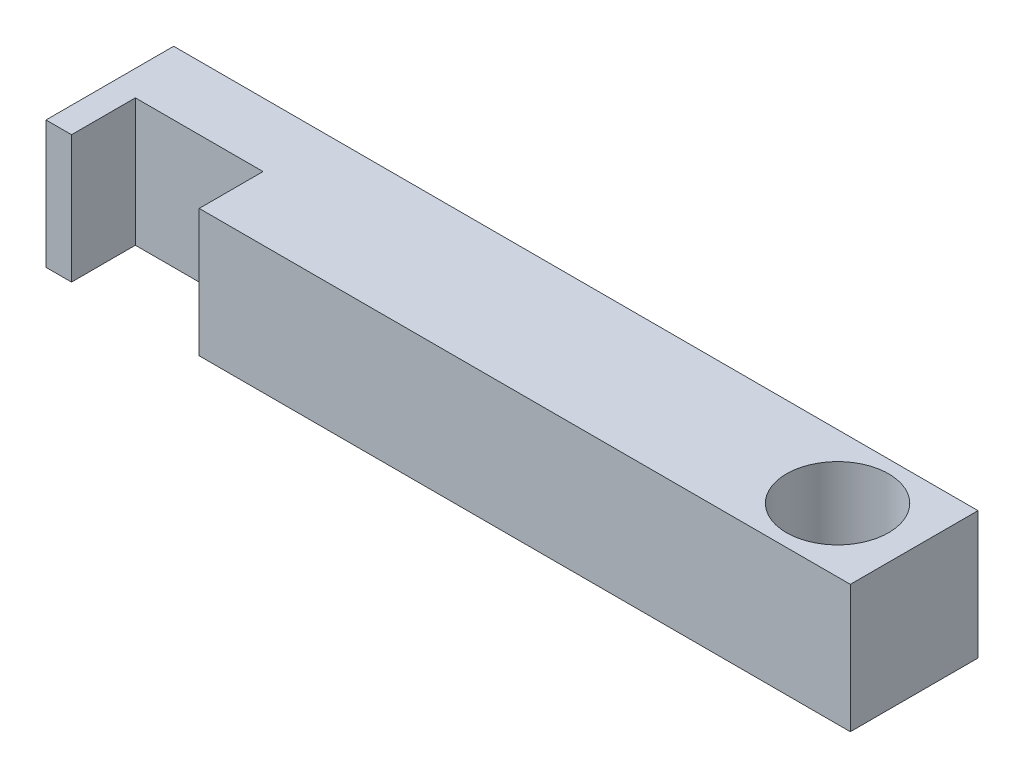
ISO-10303-21;
HEADER;
FILE_DESCRIPTION(('STEP AP214'),'2;1');
FILE_NAME('part.step','',(''),(''),'','','');
FILE_SCHEMA(('AUTOMOTIVE_DESIGN { 1 0 10303 214 1 1 1 1 }'));
ENDSEC;
DATA;
#1=APPLICATION_CONTEXT('core data for automotive mechanical design processes');
#2=APPLICATION_PROTOCOL_DEFINITION('international standard','automotive_design',2000,#1);
#3=PRODUCT_CONTEXT('',#1,'mechanical');
#4=PRODUCT('Part','Part','',(#3));
#5=PRODUCT_RELATED_PRODUCT_CATEGORY('part','',(#4));
#6=PRODUCT_DEFINITION_FORMATION('','',#4);
#7=PRODUCT_DEFINITION_CONTEXT('part definition',#1,'design');
#8=PRODUCT_DEFINITION('design','',#6,#7);
#9=PRODUCT_DEFINITION_SHAPE('','',#8);
#10=(LENGTH_UNIT() NAMED_UNIT(*) SI_UNIT(.MILLI.,.METRE.));
#11=(NAMED_UNIT(*) PLANE_ANGLE_UNIT() SI_UNIT($,.RADIAN.));
#12=(NAMED_UNIT(*) SI_UNIT($,.STERADIAN.) SOLID_ANGLE_UNIT());
#13=UNCERTAINTY_MEASURE_WITH_UNIT(LENGTH_MEASURE(1.E-05),#10,'distance_accuracy_value','');
#14=(GEOMETRIC_REPRESENTATION_CONTEXT(3) GLOBAL_UNCERTAINTY_ASSIGNED_CONTEXT((#13)) GLOBAL_UNIT_ASSIGNED_CONTEXT((#10,
#11,#12)) REPRESENTATION_CONTEXT('',''));
#15=CARTESIAN_POINT('',(0.,0.,0.));
#16=DIRECTION('',(0.,0.,1.));
#17=DIRECTION('',(1.,0.,0.));
#18=AXIS2_PLACEMENT_3D('',#15,#16,#17);
#19=CARTESIAN_POINT('',(0.,5.,0.));
#20=DIRECTION('',(0.,1.,0.));
#21=DIRECTION('',(0.,0.,1.));
#22=AXIS2_PLACEMENT_3D('',#19,#20,#21);
#23=PLANE('',#22);
#24=DIRECTION('',(0.,0.,1.));
#25=VECTOR('',#24,1.);
#26=CARTESIAN_POINT('',(-57.,5.,-5.));
#27=LINE('',#26,#25);
#28=CARTESIAN_POINT('',(-57.,5.,-5.));
#29=VERTEX_POINT('',#28);
#30=CARTESIAN_POINT('',(-57.,5.,5.));
#31=VERTEX_POINT('',#30);
#32=EDGE_CURVE('E164',#29,#31,#27,.T.);
#33=ORIENTED_EDGE('',*,*,#32,.T.);
#34=DIRECTION('',(1.,0.,0.));
#35=VECTOR('',#34,1.);
#36=CARTESIAN_POINT('',(-57.,5.,5.));
#37=LINE('',#36,#35);
#38=CARTESIAN_POINT('',(-55.,5.,5.));
#39=VERTEX_POINT('',#38);
#40=EDGE_CURVE('E100',#31,#39,#37,.T.);
#41=ORIENTED_EDGE('',*,*,#40,.T.);
#42=DIRECTION('',(0.,0.,-1.));
#43=VECTOR('',#42,1.);
#44=CARTESIAN_POINT('',(-55.,5.,5.));
#45=LINE('',#44,#43);
#46=CARTESIAN_POINT('',(-55.,5.,0.));
#47=VERTEX_POINT('',#46);
#48=EDGE_CURVE('E185',#39,#47,#45,.T.);
#49=ORIENTED_EDGE('',*,*,#48,.T.);
#50=DIRECTION('',(1.,0.,0.));
#51=VECTOR('',#50,1.);
#52=CARTESIAN_POINT('',(-55.,5.,0.));
#53=LINE('',#52,#51);
#54=CARTESIAN_POINT('',(-45.,5.,0.));
#55=VERTEX_POINT('',#54);
#56=EDGE_CURVE('E199',#47,#55,#53,.T.);
#57=ORIENTED_EDGE('',*,*,#56,.T.);
#58=DIRECTION('',(0.,0.,1.));
#59=VECTOR('',#58,1.);
#60=CARTESIAN_POINT('',(-45.,5.,0.));
#61=LINE('',#60,#59);
#62=CARTESIAN_POINT('',(-45.,5.,5.));
#63=VERTEX_POINT('',#62);
#64=EDGE_CURVE('E119',#55,#63,#61,.T.);
#65=ORIENTED_EDGE('',*,*,#64,.T.);
#66=DIRECTION('',(1.,0.,0.));
#67=VECTOR('',#66,1.);
#68=CARTESIAN_POINT('',(-45.,5.,5.));
#69=LINE('',#68,#67);
#70=CARTESIAN_POINT('',(6.,5.,5.));
#71=VERTEX_POINT('',#70);
#72=EDGE_CURVE('E113',#63,#71,#69,.T.);
#73=ORIENTED_EDGE('',*,*,#72,.T.);
#74=DIRECTION('',(0.,0.,-1.));
#75=VECTOR('',#74,1.);
#76=CARTESIAN_POINT('',(6.,5.,-5.));
#77=LINE('',#76,#75);
#78=CARTESIAN_POINT('',(6.,5.,-5.));
#79=VERTEX_POINT('',#78);
#80=EDGE_CURVE('E117',#71,#79,#77,.T.);
#81=ORIENTED_EDGE('',*,*,#80,.T.);
#82=DIRECTION('',(-1.,0.,0.));
#83=VECTOR('',#82,1.);
#84=CARTESIAN_POINT('',(-57.,5.,-5.));
#85=LINE('',#84,#83);
#86=EDGE_CURVE('E57',#79,#29,#85,.T.);
#87=ORIENTED_EDGE('',*,*,#86,.T.);
#88=EDGE_LOOP('',(#33,#41,#49,#57,#65,#73,#81,#87));
#89=FACE_BOUND('',#88,.T.);
#90=CARTESIAN_POINT('',(0.,5.,0.));
#91=DIRECTION('',(0.,1.,0.));
#92=DIRECTION('',(0.,0.,1.));
#93=AXIS2_PLACEMENT_3D('',#90,#91,#92);
#94=CIRCLE('',#93,4.);
#95=CARTESIAN_POINT('',(0.,5.,4.));
#96=VERTEX_POINT('',#95);
#97=EDGE_CURVE('E146',#96,#96,#94,.T.);
#98=ORIENTED_EDGE('',*,*,#97,.F.);
#99=EDGE_LOOP('',(#98));
#100=FACE_BOUND('',#99,.T.);
#101=ADVANCED_FACE('F39',(#89,#100),#23,.T.);
#102=CARTESIAN_POINT('',(0.,-5.,0.));
#103=DIRECTION('',(0.,1.,0.));
#104=DIRECTION('',(0.,0.,1.));
#105=AXIS2_PLACEMENT_3D('',#102,#103,#104);
#106=PLANE('',#105);
#107=DIRECTION('',(0.,0.,1.));
#108=VECTOR('',#107,1.);
#109=CARTESIAN_POINT('',(-57.,-5.,-5.));
#110=LINE('',#109,#108);
#111=CARTESIAN_POINT('',(-57.,-5.,-5.));
#112=VERTEX_POINT('',#111);
#113=CARTESIAN_POINT('',(-57.,-5.,5.));
#114=VERTEX_POINT('',#113);
#115=EDGE_CURVE('E141',#112,#114,#110,.T.);
#116=ORIENTED_EDGE('',*,*,#115,.F.);
#117=DIRECTION('',(-1.,0.,0.));
#118=VECTOR('',#117,1.);
#119=CARTESIAN_POINT('',(-57.,-5.,-5.));
#120=LINE('',#119,#118);
#121=CARTESIAN_POINT('',(6.,-5.,-5.));
#122=VERTEX_POINT('',#121);
#123=EDGE_CURVE('E92',#122,#112,#120,.T.);
#124=ORIENTED_EDGE('',*,*,#123,.F.);
#125=DIRECTION('',(0.,0.,-1.));
#126=VECTOR('',#125,1.);
#127=CARTESIAN_POINT('',(6.,-5.,-5.));
#128=LINE('',#127,#126);
#129=CARTESIAN_POINT('',(6.,-5.,5.));
#130=VERTEX_POINT('',#129);
#131=EDGE_CURVE('E86',#130,#122,#128,.T.);
#132=ORIENTED_EDGE('',*,*,#131,.F.);
#133=DIRECTION('',(1.,0.,0.));
#134=VECTOR('',#133,1.);
#135=CARTESIAN_POINT('',(-45.,-5.,5.));
#136=LINE('',#135,#134);
#137=CARTESIAN_POINT('',(-45.,-5.,5.));
#138=VERTEX_POINT('',#137);
#139=EDGE_CURVE('E128',#138,#130,#136,.T.);
#140=ORIENTED_EDGE('',*,*,#139,.F.);
#141=DIRECTION('',(0.,0.,1.));
#142=VECTOR('',#141,1.);
#143=CARTESIAN_POINT('',(-45.,-5.,0.));
#144=LINE('',#143,#142);
#145=CARTESIAN_POINT('',(-45.,-5.,0.));
#146=VERTEX_POINT('',#145);
#147=EDGE_CURVE('E155',#146,#138,#144,.T.);
#148=ORIENTED_EDGE('',*,*,#147,.F.);
#149=DIRECTION('',(1.,0.,0.));
#150=VECTOR('',#149,1.);
#151=CARTESIAN_POINT('',(-55.,-5.,0.));
#152=LINE('',#151,#150);
#153=CARTESIAN_POINT('',(-55.,-5.,0.));
#154=VERTEX_POINT('',#153);
#155=EDGE_CURVE('E152',#154,#146,#152,.T.);
#156=ORIENTED_EDGE('',*,*,#155,.F.);
#157=DIRECTION('',(0.,0.,-1.));
#158=VECTOR('',#157,1.);
#159=CARTESIAN_POINT('',(-55.,-5.,5.));
#160=LINE('',#159,#158);
#161=CARTESIAN_POINT('',(-55.,-5.,5.));
#162=VERTEX_POINT('',#161);
#163=EDGE_CURVE('E149',#162,#154,#160,.T.);
#164=ORIENTED_EDGE('',*,*,#163,.F.);
#165=DIRECTION('',(1.,0.,0.));
#166=VECTOR('',#165,1.);
#167=CARTESIAN_POINT('',(-57.,-5.,5.));
#168=LINE('',#167,#166);
#169=EDGE_CURVE('E145',#114,#162,#168,.T.);
#170=ORIENTED_EDGE('',*,*,#169,.F.);
#171=EDGE_LOOP('',(#116,#124,#132,#140,#148,#156,#164,#170));
#172=FACE_BOUND('',#171,.T.);
#173=CARTESIAN_POINT('',(0.,-5.,0.));
#174=DIRECTION('',(0.,1.,0.));
#175=DIRECTION('',(0.,0.,1.));
#176=AXIS2_PLACEMENT_3D('',#173,#174,#175);
#177=CIRCLE('',#176,4.);
#178=CARTESIAN_POINT('',(0.,-5.,4.));
#179=VERTEX_POINT('',#178);
#180=EDGE_CURVE('E209',#179,#179,#177,.T.);
#181=ORIENTED_EDGE('',*,*,#180,.T.);
#182=EDGE_LOOP('',(#181));
#183=FACE_BOUND('',#182,.T.);
#184=ADVANCED_FACE('F189',(#172,#183),#106,.F.);
#185=CARTESIAN_POINT('',(-57.,5.,-5.));
#186=DIRECTION('',(1.,0.,0.));
#187=DIRECTION('',(0.,0.,-1.));
#188=AXIS2_PLACEMENT_3D('',#185,#186,#187);
#189=PLANE('',#188);
#190=ORIENTED_EDGE('',*,*,#115,.T.);
#191=DIRECTION('',(0.,-1.,0.));
#192=VECTOR('',#191,1.);
#193=CARTESIAN_POINT('',(-57.,5.,5.));
#194=LINE('',#193,#192);
#195=EDGE_CURVE('E11',#31,#114,#194,.T.);
#196=ORIENTED_EDGE('',*,*,#195,.F.);
#197=ORIENTED_EDGE('',*,*,#32,.F.);
#198=DIRECTION('',(0.,-1.,0.));
#199=VECTOR('',#198,1.);
#200=CARTESIAN_POINT('',(-57.,5.,-5.));
#201=LINE('',#200,#199);
#202=EDGE_CURVE('E137',#29,#112,#201,.T.);
#203=ORIENTED_EDGE('',*,*,#202,.T.);
#204=EDGE_LOOP('',(#190,#196,#197,#203));
#205=FACE_BOUND('',#204,.T.);
#206=ADVANCED_FACE('F41',(#205),#189,.F.);
#207=CARTESIAN_POINT('',(-57.,5.,5.));
#208=DIRECTION('',(0.,0.,-1.));
#209=DIRECTION('',(-1.,0.,0.));
#210=AXIS2_PLACEMENT_3D('',#207,#208,#209);
#211=PLANE('',#210);
#212=ORIENTED_EDGE('',*,*,#169,.T.);
#213=DIRECTION('',(0.,-1.,0.));
#214=VECTOR('',#213,1.);
#215=CARTESIAN_POINT('',(-55.,5.,5.));
#216=LINE('',#215,#214);
#217=EDGE_CURVE('E49',#39,#162,#216,.T.);
#218=ORIENTED_EDGE('',*,*,#217,.F.);
#219=ORIENTED_EDGE('',*,*,#40,.F.);
#220=ORIENTED_EDGE('',*,*,#195,.T.);
#221=EDGE_LOOP('',(#212,#218,#219,#220));
#222=FACE_BOUND('',#221,.T.);
#223=ADVANCED_FACE('F239',(#222),#211,.F.);
#224=CARTESIAN_POINT('',(-55.,5.,5.));
#225=DIRECTION('',(-1.,0.,0.));
#226=DIRECTION('',(0.,0.,1.));
#227=AXIS2_PLACEMENT_3D('',#224,#225,#226);
#228=PLANE('',#227);
#229=ORIENTED_EDGE('',*,*,#163,.T.);
#230=DIRECTION('',(0.,-1.,0.));
#231=VECTOR('',#230,1.);
#232=CARTESIAN_POINT('',(-55.,5.,0.));
#233=LINE('',#232,#231);
#234=EDGE_CURVE('E175',#47,#154,#233,.T.);
#235=ORIENTED_EDGE('',*,*,#234,.F.);
#236=ORIENTED_EDGE('',*,*,#48,.F.);
#237=ORIENTED_EDGE('',*,*,#217,.T.);
#238=EDGE_LOOP('',(#229,#235,#236,#237));
#239=FACE_BOUND('',#238,.T.);
#240=ADVANCED_FACE('F183',(#239),#228,.F.);
#241=CARTESIAN_POINT('',(-55.,5.,0.));
#242=DIRECTION('',(0.,0.,-1.));
#243=DIRECTION('',(-1.,0.,0.));
#244=AXIS2_PLACEMENT_3D('',#241,#242,#243);
#245=PLANE('',#244);
#246=ORIENTED_EDGE('',*,*,#155,.T.);
#247=DIRECTION('',(0.,-1.,0.));
#248=VECTOR('',#247,1.);
#249=CARTESIAN_POINT('',(-45.,5.,0.));
#250=LINE('',#249,#248);
#251=EDGE_CURVE('E171',#55,#146,#250,.T.);
#252=ORIENTED_EDGE('',*,*,#251,.F.);
#253=ORIENTED_EDGE('',*,*,#56,.F.);
#254=ORIENTED_EDGE('',*,*,#234,.T.);
#255=EDGE_LOOP('',(#246,#252,#253,#254));
#256=FACE_BOUND('',#255,.T.);
#257=ADVANCED_FACE('F194',(#256),#245,.F.);
#258=CARTESIAN_POINT('',(-45.,5.,0.));
#259=DIRECTION('',(1.,0.,0.));
#260=DIRECTION('',(0.,0.,-1.));
#261=AXIS2_PLACEMENT_3D('',#258,#259,#260);
#262=PLANE('',#261);
#263=ORIENTED_EDGE('',*,*,#147,.T.);
#264=DIRECTION('',(0.,-1.,0.));
#265=VECTOR('',#264,1.);
#266=CARTESIAN_POINT('',(-45.,5.,5.));
#267=LINE('',#266,#265);
#268=EDGE_CURVE('E130',#63,#138,#267,.T.);
#269=ORIENTED_EDGE('',*,*,#268,.F.);
#270=ORIENTED_EDGE('',*,*,#64,.F.);
#271=ORIENTED_EDGE('',*,*,#251,.T.);
#272=EDGE_LOOP('',(#263,#269,#270,#271));
#273=FACE_BOUND('',#272,.T.);
#274=ADVANCED_FACE('F197',(#273),#262,.F.);
#275=CARTESIAN_POINT('',(-45.,5.,5.));
#276=DIRECTION('',(0.,0.,-1.));
#277=DIRECTION('',(-1.,0.,0.));
#278=AXIS2_PLACEMENT_3D('',#275,#276,#277);
#279=PLANE('',#278);
#280=ORIENTED_EDGE('',*,*,#139,.T.);
#281=DIRECTION('',(0.,-1.,0.));
#282=VECTOR('',#281,1.);
#283=CARTESIAN_POINT('',(6.,5.,5.));
#284=LINE('',#283,#282);
#285=EDGE_CURVE('E125',#71,#130,#284,.T.);
#286=ORIENTED_EDGE('',*,*,#285,.F.);
#287=ORIENTED_EDGE('',*,*,#72,.F.);
#288=ORIENTED_EDGE('',*,*,#268,.T.);
#289=EDGE_LOOP('',(#280,#286,#287,#288));
#290=FACE_BOUND('',#289,.T.);
#291=ADVANCED_FACE('F126',(#290),#279,.F.);
#292=CARTESIAN_POINT('',(6.,5.,-5.));
#293=DIRECTION('',(-1.,0.,0.));
#294=DIRECTION('',(0.,0.,1.));
#295=AXIS2_PLACEMENT_3D('',#292,#293,#294);
#296=PLANE('',#295);
#297=ORIENTED_EDGE('',*,*,#131,.T.);
#298=DIRECTION('',(0.,-1.,0.));
#299=VECTOR('',#298,1.);
#300=CARTESIAN_POINT('',(6.,5.,-5.));
#301=LINE('',#300,#299);
#302=EDGE_CURVE('E131',#79,#122,#301,.T.);
#303=ORIENTED_EDGE('',*,*,#302,.F.);
#304=ORIENTED_EDGE('',*,*,#80,.F.);
#305=ORIENTED_EDGE('',*,*,#285,.T.);
#306=EDGE_LOOP('',(#297,#303,#304,#305));
#307=FACE_BOUND('',#306,.T.);
#308=ADVANCED_FACE('F133',(#307),#296,.F.);
#309=CARTESIAN_POINT('',(-57.,5.,-5.));
#310=DIRECTION('',(0.,0.,1.));
#311=DIRECTION('',(1.,0.,0.));
#312=AXIS2_PLACEMENT_3D('',#309,#310,#311);
#313=PLANE('',#312);
#314=ORIENTED_EDGE('',*,*,#123,.T.);
#315=ORIENTED_EDGE('',*,*,#202,.F.);
#316=ORIENTED_EDGE('',*,*,#86,.F.);
#317=ORIENTED_EDGE('',*,*,#302,.T.);
#318=EDGE_LOOP('',(#314,#315,#316,#317));
#319=FACE_BOUND('',#318,.T.);
#320=ADVANCED_FACE('F227',(#319),#313,.F.);
#321=CARTESIAN_POINT('',(0.,5.,0.));
#322=DIRECTION('',(0.,-1.,0.));
#323=DIRECTION('',(0.,0.,-1.));
#324=AXIS2_PLACEMENT_3D('',#321,#322,#323);
#325=CYLINDRICAL_SURFACE('',#324,4.);
#326=ORIENTED_EDGE('',*,*,#97,.T.);
#327=EDGE_LOOP('',(#326));
#328=FACE_BOUND('',#327,.T.);
#329=ORIENTED_EDGE('',*,*,#180,.F.);
#330=EDGE_LOOP('',(#329));
#331=FACE_BOUND('',#330,.T.);
#332=ADVANCED_FACE('F217',(#328,#331),#325,.F.);
#333=CLOSED_SHELL('',(#101,#184,#206,#223,#240,#257,#274,#291,#308,#320,#332));
#334=MANIFOLD_SOLID_BREP('B2',#333);
#335=ADVANCED_BREP_SHAPE_REPRESENTATION('',(#18,#334),#14);
#336=SHAPE_DEFINITION_REPRESENTATION(#9,#335);
ENDSEC;
END-ISO-10303-21;
